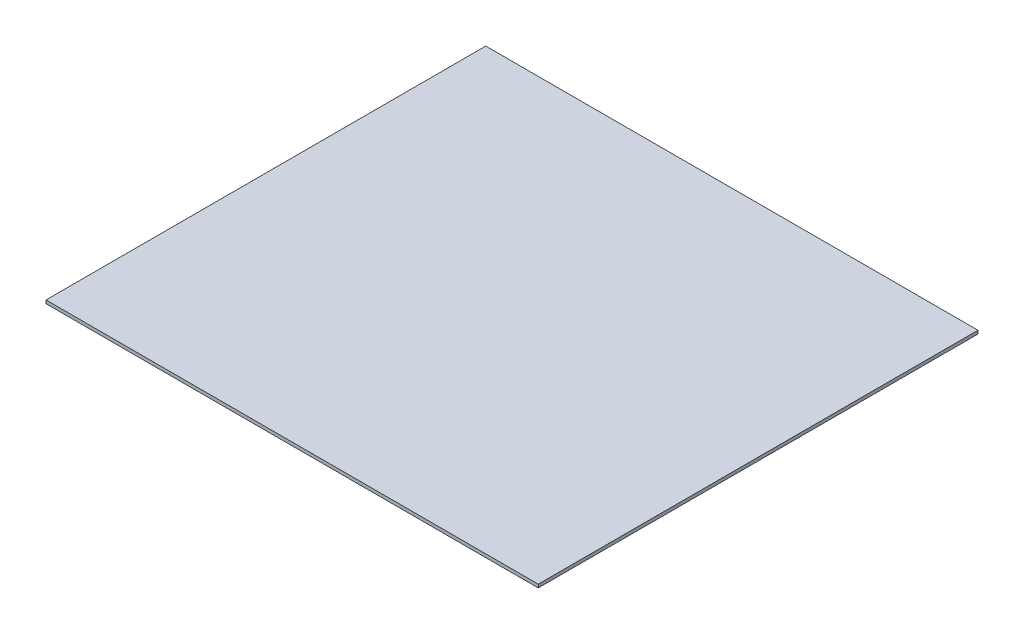
ISO-10303-21;
HEADER;
FILE_DESCRIPTION(('STEP AP214'),'2;1');
FILE_NAME('part.step','',(''),(''),'','','');
FILE_SCHEMA(('AUTOMOTIVE_DESIGN { 1 0 10303 214 1 1 1 1 }'));
ENDSEC;
DATA;
#1=APPLICATION_CONTEXT('core data for automotive mechanical design processes');
#2=APPLICATION_PROTOCOL_DEFINITION('international standard','automotive_design',2000,#1);
#3=PRODUCT_CONTEXT('',#1,'mechanical');
#4=PRODUCT('Part','Part','',(#3));
#5=PRODUCT_RELATED_PRODUCT_CATEGORY('part','',(#4));
#6=PRODUCT_DEFINITION_FORMATION('','',#4);
#7=PRODUCT_DEFINITION_CONTEXT('part definition',#1,'design');
#8=PRODUCT_DEFINITION('design','',#6,#7);
#9=PRODUCT_DEFINITION_SHAPE('','',#8);
#10=(LENGTH_UNIT() NAMED_UNIT(*) SI_UNIT(.MILLI.,.METRE.));
#11=(NAMED_UNIT(*) PLANE_ANGLE_UNIT() SI_UNIT($,.RADIAN.));
#12=(NAMED_UNIT(*) SI_UNIT($,.STERADIAN.) SOLID_ANGLE_UNIT());
#13=UNCERTAINTY_MEASURE_WITH_UNIT(LENGTH_MEASURE(1.E-05),#10,'distance_accuracy_value','');
#14=(GEOMETRIC_REPRESENTATION_CONTEXT(3) GLOBAL_UNCERTAINTY_ASSIGNED_CONTEXT((#13)) GLOBAL_UNIT_ASSIGNED_CONTEXT((#10,
#11,#12)) REPRESENTATION_CONTEXT('',''));
#15=CARTESIAN_POINT('',(0.,0.,0.));
#16=DIRECTION('',(0.,0.,1.));
#17=DIRECTION('',(1.,0.,0.));
#18=AXIS2_PLACEMENT_3D('',#15,#16,#17);
#19=CARTESIAN_POINT('',(0.,5.,0.));
#20=DIRECTION('',(-1.,0.,0.));
#21=DIRECTION('',(0.,0.,1.));
#22=AXIS2_PLACEMENT_3D('',#19,#20,#21);
#23=PLANE('',#22);
#24=DIRECTION('',(0.,0.,-1.));
#25=VECTOR('',#24,1.);
#26=CARTESIAN_POINT('',(0.,0.,0.));
#27=LINE('',#26,#25);
#28=CARTESIAN_POINT('',(0.,0.,0.));
#29=VERTEX_POINT('',#28);
#30=CARTESIAN_POINT('',(0.,0.,-670.));
#31=VERTEX_POINT('',#30);
#32=EDGE_CURVE('E98',#29,#31,#27,.T.);
#33=ORIENTED_EDGE('',*,*,#32,.T.);
#34=DIRECTION('',(0.,-1.,0.));
#35=VECTOR('',#34,1.);
#36=CARTESIAN_POINT('',(0.,5.,-670.));
#37=LINE('',#36,#35);
#38=CARTESIAN_POINT('',(0.,5.,-670.));
#39=VERTEX_POINT('',#38);
#40=EDGE_CURVE('E11',#39,#31,#37,.T.);
#41=ORIENTED_EDGE('',*,*,#40,.F.);
#42=DIRECTION('',(0.,0.,-1.));
#43=VECTOR('',#42,1.);
#44=CARTESIAN_POINT('',(0.,5.,0.));
#45=LINE('',#44,#43);
#46=CARTESIAN_POINT('',(0.,5.,0.));
#47=VERTEX_POINT('',#46);
#48=EDGE_CURVE('E86',#47,#39,#45,.T.);
#49=ORIENTED_EDGE('',*,*,#48,.F.);
#50=DIRECTION('',(0.,-1.,0.));
#51=VECTOR('',#50,1.);
#52=CARTESIAN_POINT('',(0.,5.,0.));
#53=LINE('',#52,#51);
#54=EDGE_CURVE('E94',#47,#29,#53,.T.);
#55=ORIENTED_EDGE('',*,*,#54,.T.);
#56=EDGE_LOOP('',(#33,#41,#49,#55));
#57=FACE_BOUND('',#56,.T.);
#58=ADVANCED_FACE('F35',(#57),#23,.F.);
#59=CARTESIAN_POINT('',(0.,5.,-670.));
#60=DIRECTION('',(0.,0.,1.));
#61=DIRECTION('',(1.,0.,0.));
#62=AXIS2_PLACEMENT_3D('',#59,#60,#61);
#63=PLANE('',#62);
#64=DIRECTION('',(-1.,0.,0.));
#65=VECTOR('',#64,1.);
#66=CARTESIAN_POINT('',(0.,0.,-670.));
#67=LINE('',#66,#65);
#68=CARTESIAN_POINT('',(-750.,0.,-670.));
#69=VERTEX_POINT('',#68);
#70=EDGE_CURVE('E90',#31,#69,#67,.T.);
#71=ORIENTED_EDGE('',*,*,#70,.T.);
#72=DIRECTION('',(0.,-1.,0.));
#73=VECTOR('',#72,1.);
#74=CARTESIAN_POINT('',(-750.,5.,-670.));
#75=LINE('',#74,#73);
#76=CARTESIAN_POINT('',(-750.,5.,-670.));
#77=VERTEX_POINT('',#76);
#78=EDGE_CURVE('E43',#77,#69,#75,.T.);
#79=ORIENTED_EDGE('',*,*,#78,.F.);
#80=DIRECTION('',(-1.,0.,0.));
#81=VECTOR('',#80,1.);
#82=CARTESIAN_POINT('',(0.,5.,-670.));
#83=LINE('',#82,#81);
#84=EDGE_CURVE('E81',#39,#77,#83,.T.);
#85=ORIENTED_EDGE('',*,*,#84,.F.);
#86=ORIENTED_EDGE('',*,*,#40,.T.);
#87=EDGE_LOOP('',(#71,#79,#85,#86));
#88=FACE_BOUND('',#87,.T.);
#89=ADVANCED_FACE('F89',(#88),#63,.F.);
#90=CARTESIAN_POINT('',(-750.,5.,0.));
#91=DIRECTION('',(1.,0.,0.));
#92=DIRECTION('',(0.,0.,-1.));
#93=AXIS2_PLACEMENT_3D('',#90,#91,#92);
#94=PLANE('',#93);
#95=DIRECTION('',(0.,0.,1.));
#96=VECTOR('',#95,1.);
#97=CARTESIAN_POINT('',(-750.,0.,0.));
#98=LINE('',#97,#96);
#99=CARTESIAN_POINT('',(-750.,0.,0.));
#100=VERTEX_POINT('',#99);
#101=EDGE_CURVE('E68',#69,#100,#98,.T.);
#102=ORIENTED_EDGE('',*,*,#101,.T.);
#103=DIRECTION('',(0.,-1.,0.));
#104=VECTOR('',#103,1.);
#105=CARTESIAN_POINT('',(-750.,5.,0.));
#106=LINE('',#105,#104);
#107=CARTESIAN_POINT('',(-750.,5.,0.));
#108=VERTEX_POINT('',#107);
#109=EDGE_CURVE('E91',#108,#100,#106,.T.);
#110=ORIENTED_EDGE('',*,*,#109,.F.);
#111=DIRECTION('',(0.,0.,1.));
#112=VECTOR('',#111,1.);
#113=CARTESIAN_POINT('',(-750.,5.,0.));
#114=LINE('',#113,#112);
#115=EDGE_CURVE('E84',#77,#108,#114,.T.);
#116=ORIENTED_EDGE('',*,*,#115,.F.);
#117=ORIENTED_EDGE('',*,*,#78,.T.);
#118=EDGE_LOOP('',(#102,#110,#116,#117));
#119=FACE_BOUND('',#118,.T.);
#120=ADVANCED_FACE('F92',(#119),#94,.F.);
#121=CARTESIAN_POINT('',(0.,5.,0.));
#122=DIRECTION('',(0.,0.,-1.));
#123=DIRECTION('',(-1.,0.,0.));
#124=AXIS2_PLACEMENT_3D('',#121,#122,#123);
#125=PLANE('',#124);
#126=DIRECTION('',(1.,0.,0.));
#127=VECTOR('',#126,1.);
#128=CARTESIAN_POINT('',(0.,0.,0.));
#129=LINE('',#128,#127);
#130=EDGE_CURVE('E74',#100,#29,#129,.T.);
#131=ORIENTED_EDGE('',*,*,#130,.T.);
#132=ORIENTED_EDGE('',*,*,#54,.F.);
#133=DIRECTION('',(1.,0.,0.));
#134=VECTOR('',#133,1.);
#135=CARTESIAN_POINT('',(0.,5.,0.));
#136=LINE('',#135,#134);
#137=EDGE_CURVE('E51',#108,#47,#136,.T.);
#138=ORIENTED_EDGE('',*,*,#137,.F.);
#139=ORIENTED_EDGE('',*,*,#109,.T.);
#140=EDGE_LOOP('',(#131,#132,#138,#139));
#141=FACE_BOUND('',#140,.T.);
#142=ADVANCED_FACE('F105',(#141),#125,.F.);
#143=CARTESIAN_POINT('',(0.,5.,0.));
#144=DIRECTION('',(0.,1.,0.));
#145=DIRECTION('',(0.,0.,1.));
#146=AXIS2_PLACEMENT_3D('',#143,#144,#145);
#147=PLANE('',#146);
#148=ORIENTED_EDGE('',*,*,#48,.T.);
#149=ORIENTED_EDGE('',*,*,#84,.T.);
#150=ORIENTED_EDGE('',*,*,#115,.T.);
#151=ORIENTED_EDGE('',*,*,#137,.T.);
#152=EDGE_LOOP('',(#148,#149,#150,#151));
#153=FACE_BOUND('',#152,.T.);
#154=ADVANCED_FACE('F82',(#153),#147,.T.);
#155=CARTESIAN_POINT('',(0.,0.,0.));
#156=DIRECTION('',(0.,1.,0.));
#157=DIRECTION('',(0.,0.,1.));
#158=AXIS2_PLACEMENT_3D('',#155,#156,#157);
#159=PLANE('',#158);
#160=ORIENTED_EDGE('',*,*,#32,.F.);
#161=ORIENTED_EDGE('',*,*,#130,.F.);
#162=ORIENTED_EDGE('',*,*,#101,.F.);
#163=ORIENTED_EDGE('',*,*,#70,.F.);
#164=EDGE_LOOP('',(#160,#161,#162,#163));
#165=FACE_BOUND('',#164,.T.);
#166=ADVANCED_FACE('F108',(#165),#159,.F.);
#167=CLOSED_SHELL('',(#58,#89,#120,#142,#154,#166));
#168=MANIFOLD_SOLID_BREP('B2',#167);
#169=ADVANCED_BREP_SHAPE_REPRESENTATION('',(#18,#168),#14);
#170=SHAPE_DEFINITION_REPRESENTATION(#9,#169);
ENDSEC;
END-ISO-10303-21;
